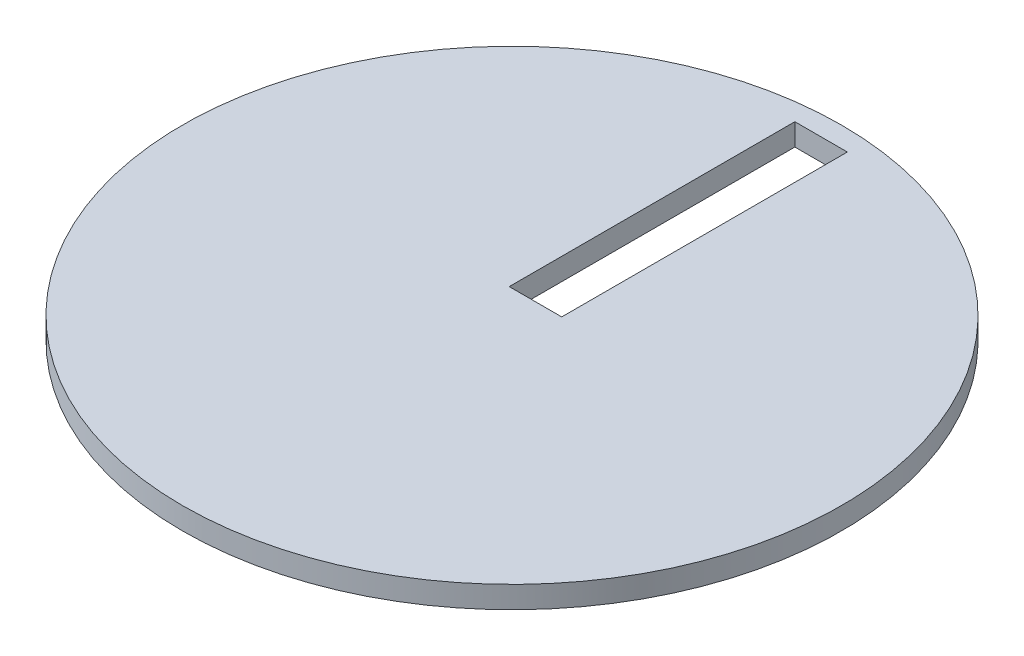
ISO-10303-21;
HEADER;
FILE_DESCRIPTION(('STEP AP214'),'2;1');
FILE_NAME('part.step','',(''),(''),'','','');
FILE_SCHEMA(('AUTOMOTIVE_DESIGN { 1 0 10303 214 1 1 1 1 }'));
ENDSEC;
DATA;
#1=APPLICATION_CONTEXT('core data for automotive mechanical design processes');
#2=APPLICATION_PROTOCOL_DEFINITION('international standard','automotive_design',2000,#1);
#3=PRODUCT_CONTEXT('',#1,'mechanical');
#4=PRODUCT('Part','Part','',(#3));
#5=PRODUCT_RELATED_PRODUCT_CATEGORY('part','',(#4));
#6=PRODUCT_DEFINITION_FORMATION('','',#4);
#7=PRODUCT_DEFINITION_CONTEXT('part definition',#1,'design');
#8=PRODUCT_DEFINITION('design','',#6,#7);
#9=PRODUCT_DEFINITION_SHAPE('','',#8);
#10=(LENGTH_UNIT() NAMED_UNIT(*) SI_UNIT(.MILLI.,.METRE.));
#11=(NAMED_UNIT(*) PLANE_ANGLE_UNIT() SI_UNIT($,.RADIAN.));
#12=(NAMED_UNIT(*) SI_UNIT($,.STERADIAN.) SOLID_ANGLE_UNIT());
#13=UNCERTAINTY_MEASURE_WITH_UNIT(LENGTH_MEASURE(1.E-05),#10,'distance_accuracy_value','');
#14=(GEOMETRIC_REPRESENTATION_CONTEXT(3) GLOBAL_UNCERTAINTY_ASSIGNED_CONTEXT((#13)) GLOBAL_UNIT_ASSIGNED_CONTEXT((#10,
#11,#12)) REPRESENTATION_CONTEXT('',''));
#15=CARTESIAN_POINT('',(0.,0.,0.));
#16=DIRECTION('',(0.,0.,1.));
#17=DIRECTION('',(1.,0.,0.));
#18=AXIS2_PLACEMENT_3D('',#15,#16,#17);
#19=CARTESIAN_POINT('',(0.,10.,0.));
#20=DIRECTION('',(0.,-1.,0.));
#21=DIRECTION('',(0.,0.,-1.));
#22=AXIS2_PLACEMENT_3D('',#19,#20,#21);
#23=CYLINDRICAL_SURFACE('',#22,150.);
#24=CARTESIAN_POINT('',(0.,10.,0.));
#25=DIRECTION('',(0.,1.,0.));
#26=DIRECTION('',(0.,0.,1.));
#27=AXIS2_PLACEMENT_3D('',#24,#25,#26);
#28=CIRCLE('',#27,150.);
#29=CARTESIAN_POINT('',(0.,10.,150.));
#30=VERTEX_POINT('',#29);
#31=EDGE_CURVE('E11',#30,#30,#28,.T.);
#32=ORIENTED_EDGE('',*,*,#31,.F.);
#33=EDGE_LOOP('',(#32));
#34=FACE_BOUND('',#33,.T.);
#35=CARTESIAN_POINT('',(0.,0.,0.));
#36=DIRECTION('',(0.,1.,0.));
#37=DIRECTION('',(0.,0.,1.));
#38=AXIS2_PLACEMENT_3D('',#35,#36,#37);
#39=CIRCLE('',#38,150.);
#40=CARTESIAN_POINT('',(0.,0.,150.));
#41=VERTEX_POINT('',#40);
#42=EDGE_CURVE('E42',#41,#41,#39,.T.);
#43=ORIENTED_EDGE('',*,*,#42,.T.);
#44=EDGE_LOOP('',(#43));
#45=FACE_BOUND('',#44,.T.);
#46=ADVANCED_FACE('F39',(#34,#45),#23,.T.);
#47=CARTESIAN_POINT('',(0.,10.,0.));
#48=DIRECTION('',(0.,1.,0.));
#49=DIRECTION('',(0.,0.,1.));
#50=AXIS2_PLACEMENT_3D('',#47,#48,#49);
#51=PLANE('',#50);
#52=DIRECTION('',(0.,0.,-1.));
#53=VECTOR('',#52,1.);
#54=CARTESIAN_POINT('',(11.9454945961296,10.,-140.688074112327));
#55=LINE('',#54,#53);
#56=CARTESIAN_POINT('',(11.9454945961296,10.,-10.6880741123265));
#57=VERTEX_POINT('',#56);
#58=CARTESIAN_POINT('',(11.9454945961296,10.,-140.688074112327));
#59=VERTEX_POINT('',#58);
#60=EDGE_CURVE('E54',#57,#59,#55,.T.);
#61=ORIENTED_EDGE('',*,*,#60,.F.);
#62=DIRECTION('',(1.,0.,0.));
#63=VECTOR('',#62,1.);
#64=CARTESIAN_POINT('',(-11.9454945961296,10.,-10.6880741123265));
#65=LINE('',#64,#63);
#66=CARTESIAN_POINT('',(-11.9454945961296,10.,-10.6880741123265));
#67=VERTEX_POINT('',#66);
#68=EDGE_CURVE('E101',#67,#57,#65,.T.);
#69=ORIENTED_EDGE('',*,*,#68,.F.);
#70=DIRECTION('',(0.,0.,1.));
#71=VECTOR('',#70,1.);
#72=CARTESIAN_POINT('',(-11.9454945961296,10.,-140.688074112327));
#73=LINE('',#72,#71);
#74=CARTESIAN_POINT('',(-11.9454945961296,10.,-140.688074112327));
#75=VERTEX_POINT('',#74);
#76=EDGE_CURVE('E105',#75,#67,#73,.T.);
#77=ORIENTED_EDGE('',*,*,#76,.F.);
#78=DIRECTION('',(-1.,0.,0.));
#79=VECTOR('',#78,1.);
#80=CARTESIAN_POINT('',(-11.9454945961296,10.,-140.688074112327));
#81=LINE('',#80,#79);
#82=EDGE_CURVE('E114',#59,#75,#81,.T.);
#83=ORIENTED_EDGE('',*,*,#82,.F.);
#84=EDGE_LOOP('',(#61,#69,#77,#83));
#85=FACE_BOUND('',#84,.T.);
#86=ORIENTED_EDGE('',*,*,#31,.T.);
#87=EDGE_LOOP('',(#86));
#88=FACE_BOUND('',#87,.T.);
#89=ADVANCED_FACE('F131',(#85,#88),#51,.T.);
#90=CARTESIAN_POINT('',(0.,0.,0.));
#91=DIRECTION('',(0.,1.,0.));
#92=DIRECTION('',(0.,0.,1.));
#93=AXIS2_PLACEMENT_3D('',#90,#91,#92);
#94=PLANE('',#93);
#95=DIRECTION('',(1.,0.,0.));
#96=VECTOR('',#95,1.);
#97=CARTESIAN_POINT('',(-11.9454945961296,0.,-10.6880741123265));
#98=LINE('',#97,#96);
#99=CARTESIAN_POINT('',(-11.9454945961296,0.,-10.6880741123265));
#100=VERTEX_POINT('',#99);
#101=CARTESIAN_POINT('',(11.9454945961296,0.,-10.6880741123265));
#102=VERTEX_POINT('',#101);
#103=EDGE_CURVE('E89',#100,#102,#98,.T.);
#104=ORIENTED_EDGE('',*,*,#103,.T.);
#105=DIRECTION('',(0.,0.,-1.));
#106=VECTOR('',#105,1.);
#107=CARTESIAN_POINT('',(11.9454945961296,0.,-140.688074112327));
#108=LINE('',#107,#106);
#109=CARTESIAN_POINT('',(11.9454945961296,0.,-140.688074112327));
#110=VERTEX_POINT('',#109);
#111=EDGE_CURVE('E82',#102,#110,#108,.T.);
#112=ORIENTED_EDGE('',*,*,#111,.T.);
#113=DIRECTION('',(-1.,0.,0.));
#114=VECTOR('',#113,1.);
#115=CARTESIAN_POINT('',(-11.9454945961296,0.,-140.688074112327));
#116=LINE('',#115,#114);
#117=CARTESIAN_POINT('',(-11.9454945961296,0.,-140.688074112327));
#118=VERTEX_POINT('',#117);
#119=EDGE_CURVE('E92',#110,#118,#116,.T.);
#120=ORIENTED_EDGE('',*,*,#119,.T.);
#121=DIRECTION('',(0.,0.,1.));
#122=VECTOR('',#121,1.);
#123=CARTESIAN_POINT('',(-11.9454945961296,0.,-140.688074112327));
#124=LINE('',#123,#122);
#125=EDGE_CURVE('E62',#118,#100,#124,.T.);
#126=ORIENTED_EDGE('',*,*,#125,.T.);
#127=EDGE_LOOP('',(#104,#112,#120,#126));
#128=FACE_BOUND('',#127,.T.);
#129=ORIENTED_EDGE('',*,*,#42,.F.);
#130=EDGE_LOOP('',(#129));
#131=FACE_BOUND('',#130,.T.);
#132=ADVANCED_FACE('F97',(#128,#131),#94,.F.);
#133=CARTESIAN_POINT('',(11.9454945961296,0.,-140.688074112327));
#134=DIRECTION('',(1.,0.,0.));
#135=DIRECTION('',(0.,0.,-1.));
#136=AXIS2_PLACEMENT_3D('',#133,#134,#135);
#137=PLANE('',#136);
#138=ORIENTED_EDGE('',*,*,#60,.T.);
#139=DIRECTION('',(0.,1.,0.));
#140=VECTOR('',#139,1.);
#141=CARTESIAN_POINT('',(11.9454945961296,0.,-140.688074112327));
#142=LINE('',#141,#140);
#143=EDGE_CURVE('E78',#110,#59,#142,.T.);
#144=ORIENTED_EDGE('',*,*,#143,.F.);
#145=ORIENTED_EDGE('',*,*,#111,.F.);
#146=DIRECTION('',(0.,1.,0.));
#147=VECTOR('',#146,1.);
#148=CARTESIAN_POINT('',(11.9454945961296,0.,-10.6880741123265));
#149=LINE('',#148,#147);
#150=EDGE_CURVE('E120',#102,#57,#149,.T.);
#151=ORIENTED_EDGE('',*,*,#150,.T.);
#152=EDGE_LOOP('',(#138,#144,#145,#151));
#153=FACE_BOUND('',#152,.T.);
#154=ADVANCED_FACE('F80',(#153),#137,.F.);
#155=CARTESIAN_POINT('',(-11.9454945961296,0.,-10.6880741123265));
#156=DIRECTION('',(0.,0.,1.));
#157=DIRECTION('',(1.,0.,0.));
#158=AXIS2_PLACEMENT_3D('',#155,#156,#157);
#159=PLANE('',#158);
#160=ORIENTED_EDGE('',*,*,#68,.T.);
#161=ORIENTED_EDGE('',*,*,#150,.F.);
#162=ORIENTED_EDGE('',*,*,#103,.F.);
#163=DIRECTION('',(0.,1.,0.));
#164=VECTOR('',#163,1.);
#165=CARTESIAN_POINT('',(-11.9454945961296,0.,-10.6880741123265));
#166=LINE('',#165,#164);
#167=EDGE_CURVE('E123',#100,#67,#166,.T.);
#168=ORIENTED_EDGE('',*,*,#167,.T.);
#169=EDGE_LOOP('',(#160,#161,#162,#168));
#170=FACE_BOUND('',#169,.T.);
#171=ADVANCED_FACE('F134',(#170),#159,.F.);
#172=CARTESIAN_POINT('',(-11.9454945961296,0.,-140.688074112327));
#173=DIRECTION('',(-1.,0.,0.));
#174=DIRECTION('',(0.,0.,1.));
#175=AXIS2_PLACEMENT_3D('',#172,#173,#174);
#176=PLANE('',#175);
#177=ORIENTED_EDGE('',*,*,#76,.T.);
#178=ORIENTED_EDGE('',*,*,#167,.F.);
#179=ORIENTED_EDGE('',*,*,#125,.F.);
#180=DIRECTION('',(0.,1.,0.));
#181=VECTOR('',#180,1.);
#182=CARTESIAN_POINT('',(-11.9454945961296,0.,-140.688074112327));
#183=LINE('',#182,#181);
#184=EDGE_CURVE('E88',#118,#75,#183,.T.);
#185=ORIENTED_EDGE('',*,*,#184,.T.);
#186=EDGE_LOOP('',(#177,#178,#179,#185));
#187=FACE_BOUND('',#186,.T.);
#188=ADVANCED_FACE('F127',(#187),#176,.F.);
#189=CARTESIAN_POINT('',(-11.9454945961296,0.,-140.688074112327));
#190=DIRECTION('',(0.,0.,-1.));
#191=DIRECTION('',(-1.,0.,0.));
#192=AXIS2_PLACEMENT_3D('',#189,#190,#191);
#193=PLANE('',#192);
#194=ORIENTED_EDGE('',*,*,#82,.T.);
#195=ORIENTED_EDGE('',*,*,#184,.F.);
#196=ORIENTED_EDGE('',*,*,#119,.F.);
#197=ORIENTED_EDGE('',*,*,#143,.T.);
#198=EDGE_LOOP('',(#194,#195,#196,#197));
#199=FACE_BOUND('',#198,.T.);
#200=ADVANCED_FACE('F93',(#199),#193,.F.);
#201=CLOSED_SHELL('',(#46,#89,#132,#154,#171,#188,#200));
#202=MANIFOLD_SOLID_BREP('B2',#201);
#203=ADVANCED_BREP_SHAPE_REPRESENTATION('',(#18,#202),#14);
#204=SHAPE_DEFINITION_REPRESENTATION(#9,#203);
ENDSEC;
END-ISO-10303-21;
